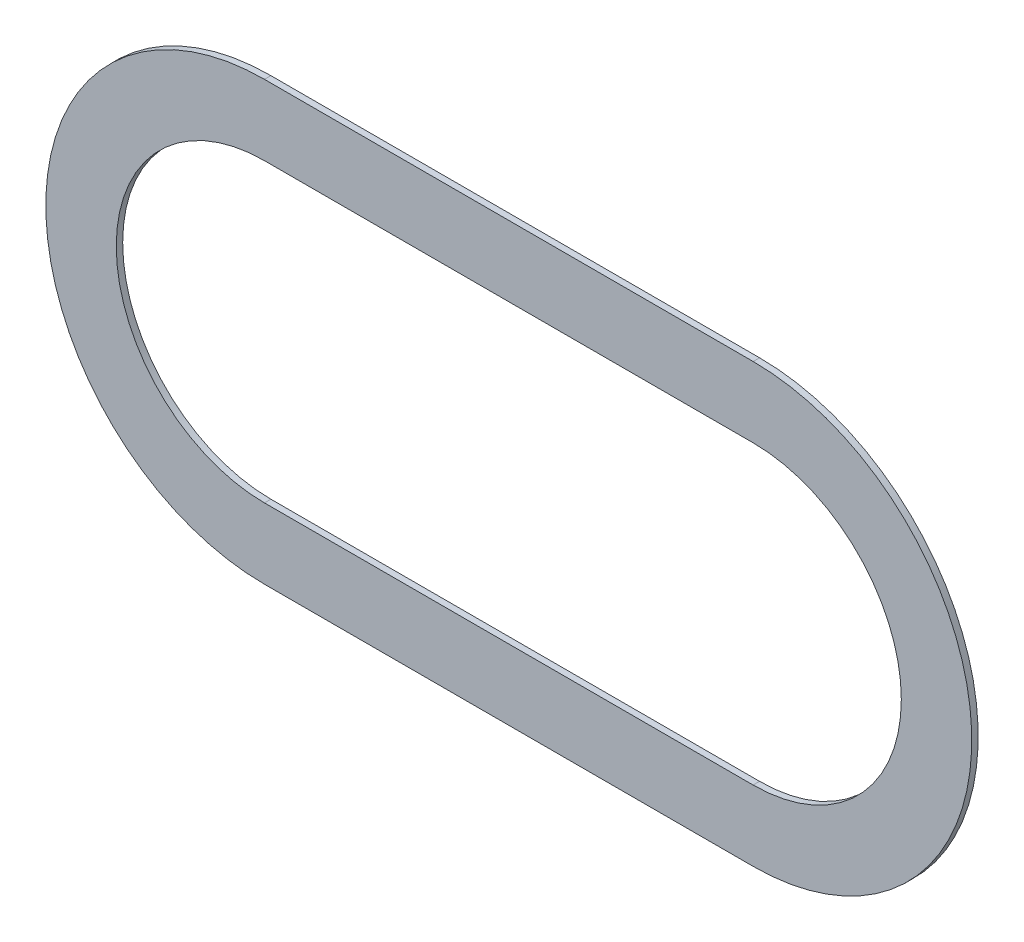
ISO-10303-21;
HEADER;
FILE_DESCRIPTION(('STEP AP214'),'2;1');
FILE_NAME('part.step','',(''),(''),'','','');
FILE_SCHEMA(('AUTOMOTIVE_DESIGN { 1 0 10303 214 1 1 1 1 }'));
ENDSEC;
DATA;
#1=APPLICATION_CONTEXT('core data for automotive mechanical design processes');
#2=APPLICATION_PROTOCOL_DEFINITION('international standard','automotive_design',2000,#1);
#3=PRODUCT_CONTEXT('',#1,'mechanical');
#4=PRODUCT('Part','Part','',(#3));
#5=PRODUCT_RELATED_PRODUCT_CATEGORY('part','',(#4));
#6=PRODUCT_DEFINITION_FORMATION('','',#4);
#7=PRODUCT_DEFINITION_CONTEXT('part definition',#1,'design');
#8=PRODUCT_DEFINITION('design','',#6,#7);
#9=PRODUCT_DEFINITION_SHAPE('','',#8);
#10=(LENGTH_UNIT() NAMED_UNIT(*) SI_UNIT(.MILLI.,.METRE.));
#11=(NAMED_UNIT(*) PLANE_ANGLE_UNIT() SI_UNIT($,.RADIAN.));
#12=(NAMED_UNIT(*) SI_UNIT($,.STERADIAN.) SOLID_ANGLE_UNIT());
#13=UNCERTAINTY_MEASURE_WITH_UNIT(LENGTH_MEASURE(1.E-05),#10,'distance_accuracy_value','');
#14=(GEOMETRIC_REPRESENTATION_CONTEXT(3) GLOBAL_UNCERTAINTY_ASSIGNED_CONTEXT((#13)) GLOBAL_UNIT_ASSIGNED_CONTEXT((#10,
#11,#12)) REPRESENTATION_CONTEXT('',''));
#15=CARTESIAN_POINT('',(0.,0.,0.));
#16=DIRECTION('',(0.,0.,1.));
#17=DIRECTION('',(1.,0.,0.));
#18=AXIS2_PLACEMENT_3D('',#15,#16,#17);
#19=CARTESIAN_POINT('',(22.4500010663178,4.93000023416243,0.));
#20=DIRECTION('',(0.,0.,-1.));
#21=DIRECTION('',(0.,-1.,0.));
#22=AXIS2_PLACEMENT_3D('',#19,#20,#21);
#23=PLANE('',#22);
#24=CARTESIAN_POINT('',(22.6400010753423,4.93000023416243,0.));
#25=DIRECTION('',(0.,0.,1.));
#26=DIRECTION('',(0.,1.,0.));
#27=AXIS2_PLACEMENT_3D('',#24,#25,#26);
#28=CIRCLE('',#27,0.115221704027137);
#29=CARTESIAN_POINT('',(22.6400010753423,4.8147785301353,0.));
#30=VERTEX_POINT('',#29);
#31=CARTESIAN_POINT('',(22.6400010753423,5.04522193818957,0.));
#32=VERTEX_POINT('',#31);
#33=EDGE_CURVE('E158',#30,#32,#28,.T.);
#34=ORIENTED_EDGE('',*,*,#33,.F.);
#35=DIRECTION('',(1.,0.,0.));
#36=VECTOR('',#35,1.);
#37=CARTESIAN_POINT('',(22.6400010753423,4.8147785301353,0.));
#38=LINE('',#37,#36);
#39=CARTESIAN_POINT('',(22.2600010572933,4.8147785301353,0.));
#40=VERTEX_POINT('',#39);
#41=EDGE_CURVE('E123',#40,#30,#38,.T.);
#42=ORIENTED_EDGE('',*,*,#41,.F.);
#43=CARTESIAN_POINT('',(22.2600010572933,4.93000023416243,0.));
#44=DIRECTION('',(0.,0.,1.));
#45=DIRECTION('',(0.,-1.,0.));
#46=AXIS2_PLACEMENT_3D('',#43,#44,#45);
#47=CIRCLE('',#46,0.115221704027137);
#48=CARTESIAN_POINT('',(22.2600010572933,5.04522193818957,0.));
#49=VERTEX_POINT('',#48);
#50=EDGE_CURVE('E115',#49,#40,#47,.T.);
#51=ORIENTED_EDGE('',*,*,#50,.F.);
#52=DIRECTION('',(-1.,0.,0.));
#53=VECTOR('',#52,1.);
#54=CARTESIAN_POINT('',(22.2600010572933,5.04522193818957,0.));
#55=LINE('',#54,#53);
#56=EDGE_CURVE('E99',#32,#49,#55,.T.);
#57=ORIENTED_EDGE('',*,*,#56,.F.);
#58=EDGE_LOOP('',(#34,#42,#51,#57));
#59=FACE_BOUND('',#58,.T.);
#60=CARTESIAN_POINT('',(22.6400010753423,4.93000023416243,0.));
#61=DIRECTION('',(0.,0.,-1.));
#62=DIRECTION('',(0.,1.,0.));
#63=AXIS2_PLACEMENT_3D('',#60,#61,#62);
#64=CIRCLE('',#63,0.170000008074567);
#65=CARTESIAN_POINT('',(22.6400010753423,5.100000242237,0.));
#66=VERTEX_POINT('',#65);
#67=CARTESIAN_POINT('',(22.6400010753423,4.76000022608787,0.));
#68=VERTEX_POINT('',#67);
#69=EDGE_CURVE('E28',#66,#68,#64,.T.);
#70=ORIENTED_EDGE('',*,*,#69,.F.);
#71=DIRECTION('',(1.,0.,0.));
#72=VECTOR('',#71,1.);
#73=CARTESIAN_POINT('',(22.2600010572933,5.100000242237,0.));
#74=LINE('',#73,#72);
#75=CARTESIAN_POINT('',(22.2600010572933,5.100000242237,0.));
#76=VERTEX_POINT('',#75);
#77=EDGE_CURVE('E142',#76,#66,#74,.T.);
#78=ORIENTED_EDGE('',*,*,#77,.F.);
#79=CARTESIAN_POINT('',(22.2600010572933,4.93000023416243,0.));
#80=DIRECTION('',(0.,0.,-1.));
#81=DIRECTION('',(0.,-1.,0.));
#82=AXIS2_PLACEMENT_3D('',#79,#80,#81);
#83=CIRCLE('',#82,0.170000008074567);
#84=CARTESIAN_POINT('',(22.2600010572933,4.76000022608787,0.));
#85=VERTEX_POINT('',#84);
#86=EDGE_CURVE('E153',#85,#76,#83,.T.);
#87=ORIENTED_EDGE('',*,*,#86,.F.);
#88=DIRECTION('',(-1.,0.,0.));
#89=VECTOR('',#88,1.);
#90=CARTESIAN_POINT('',(22.6400010753423,4.76000022608787,0.));
#91=LINE('',#90,#89);
#92=EDGE_CURVE('E162',#68,#85,#91,.T.);
#93=ORIENTED_EDGE('',*,*,#92,.F.);
#94=EDGE_LOOP('',(#70,#78,#87,#93));
#95=FACE_BOUND('',#94,.T.);
#96=ADVANCED_FACE('F17',(#59,#95),#23,.F.);
#97=CARTESIAN_POINT('',(22.4500010663178,4.93000023416243,-0.005));
#98=DIRECTION('',(0.,0.,-1.));
#99=DIRECTION('',(0.,-1.,0.));
#100=AXIS2_PLACEMENT_3D('',#97,#98,#99);
#101=PLANE('',#100);
#102=CARTESIAN_POINT('',(22.6400010753423,4.93000023416243,-0.005));
#103=DIRECTION('',(0.,0.,1.));
#104=DIRECTION('',(0.,1.,0.));
#105=AXIS2_PLACEMENT_3D('',#102,#103,#104);
#106=CIRCLE('',#105,0.115221704027137);
#107=CARTESIAN_POINT('',(22.6400010753423,4.8147785301353,-0.005));
#108=VERTEX_POINT('',#107);
#109=CARTESIAN_POINT('',(22.6400010753423,5.04522193818957,-0.005));
#110=VERTEX_POINT('',#109);
#111=EDGE_CURVE('E161',#108,#110,#106,.T.);
#112=ORIENTED_EDGE('',*,*,#111,.T.);
#113=DIRECTION('',(-1.,0.,0.));
#114=VECTOR('',#113,1.);
#115=CARTESIAN_POINT('',(22.2600010572933,5.04522193818957,-0.005));
#116=LINE('',#115,#114);
#117=CARTESIAN_POINT('',(22.2600010572933,5.04522193818957,-0.005));
#118=VERTEX_POINT('',#117);
#119=EDGE_CURVE('E109',#110,#118,#116,.T.);
#120=ORIENTED_EDGE('',*,*,#119,.T.);
#121=CARTESIAN_POINT('',(22.2600010572933,4.93000023416243,-0.005));
#122=DIRECTION('',(0.,0.,1.));
#123=DIRECTION('',(0.,-1.,0.));
#124=AXIS2_PLACEMENT_3D('',#121,#122,#123);
#125=CIRCLE('',#124,0.115221704027137);
#126=CARTESIAN_POINT('',(22.2600010572933,4.8147785301353,-0.005));
#127=VERTEX_POINT('',#126);
#128=EDGE_CURVE('E117',#118,#127,#125,.T.);
#129=ORIENTED_EDGE('',*,*,#128,.T.);
#130=DIRECTION('',(1.,0.,0.));
#131=VECTOR('',#130,1.);
#132=CARTESIAN_POINT('',(22.6400010753423,4.8147785301353,-0.005));
#133=LINE('',#132,#131);
#134=EDGE_CURVE('E131',#127,#108,#133,.T.);
#135=ORIENTED_EDGE('',*,*,#134,.T.);
#136=EDGE_LOOP('',(#112,#120,#129,#135));
#137=FACE_BOUND('',#136,.T.);
#138=CARTESIAN_POINT('',(22.6400010753423,4.93000023416243,-0.005));
#139=DIRECTION('',(0.,0.,-1.));
#140=DIRECTION('',(0.,1.,0.));
#141=AXIS2_PLACEMENT_3D('',#138,#139,#140);
#142=CIRCLE('',#141,0.170000008074567);
#143=CARTESIAN_POINT('',(22.6400010753423,5.100000242237,-0.005));
#144=VERTEX_POINT('',#143);
#145=CARTESIAN_POINT('',(22.6400010753423,4.76000022608787,-0.005));
#146=VERTEX_POINT('',#145);
#147=EDGE_CURVE('E11',#144,#146,#142,.T.);
#148=ORIENTED_EDGE('',*,*,#147,.T.);
#149=DIRECTION('',(-1.,0.,0.));
#150=VECTOR('',#149,1.);
#151=CARTESIAN_POINT('',(22.6400010753423,4.76000022608787,-0.005));
#152=LINE('',#151,#150);
#153=CARTESIAN_POINT('',(22.2600010572933,4.76000022608787,-0.005));
#154=VERTEX_POINT('',#153);
#155=EDGE_CURVE('E165',#146,#154,#152,.T.);
#156=ORIENTED_EDGE('',*,*,#155,.T.);
#157=CARTESIAN_POINT('',(22.2600010572933,4.93000023416243,-0.005));
#158=DIRECTION('',(0.,0.,-1.));
#159=DIRECTION('',(0.,-1.,0.));
#160=AXIS2_PLACEMENT_3D('',#157,#158,#159);
#161=CIRCLE('',#160,0.170000008074567);
#162=CARTESIAN_POINT('',(22.2600010572933,5.100000242237,-0.005));
#163=VERTEX_POINT('',#162);
#164=EDGE_CURVE('E21',#154,#163,#161,.T.);
#165=ORIENTED_EDGE('',*,*,#164,.T.);
#166=DIRECTION('',(1.,0.,0.));
#167=VECTOR('',#166,1.);
#168=CARTESIAN_POINT('',(22.2600010572933,5.100000242237,-0.005));
#169=LINE('',#168,#167);
#170=EDGE_CURVE('E141',#163,#144,#169,.T.);
#171=ORIENTED_EDGE('',*,*,#170,.T.);
#172=EDGE_LOOP('',(#148,#156,#165,#171));
#173=FACE_BOUND('',#172,.T.);
#174=ADVANCED_FACE('F204',(#137,#173),#101,.T.);
#175=CARTESIAN_POINT('',(22.6400010753423,4.93000023416243,0.));
#176=DIRECTION('',(0.,0.,-1.));
#177=DIRECTION('',(0.,1.,0.));
#178=AXIS2_PLACEMENT_3D('',#175,#176,#177);
#179=CYLINDRICAL_SURFACE('',#178,0.170000008074567);
#180=ORIENTED_EDGE('',*,*,#69,.T.);
#181=DIRECTION('',(0.,0.,-1.));
#182=VECTOR('',#181,1.);
#183=CARTESIAN_POINT('',(22.6400010753423,4.76000022608787,0.));
#184=LINE('',#183,#182);
#185=EDGE_CURVE('E169',#68,#146,#184,.T.);
#186=ORIENTED_EDGE('',*,*,#185,.T.);
#187=ORIENTED_EDGE('',*,*,#147,.F.);
#188=DIRECTION('',(0.,0.,-1.));
#189=VECTOR('',#188,1.);
#190=CARTESIAN_POINT('',(22.6400010753423,5.100000242237,0.));
#191=LINE('',#190,#189);
#192=EDGE_CURVE('E137',#66,#144,#191,.T.);
#193=ORIENTED_EDGE('',*,*,#192,.F.);
#194=EDGE_LOOP('',(#180,#186,#187,#193));
#195=FACE_BOUND('',#194,.T.);
#196=ADVANCED_FACE('F189',(#195),#179,.T.);
#197=CARTESIAN_POINT('',(22.6400010753423,4.76000022608787,0.));
#198=DIRECTION('',(0.,-1.,0.));
#199=DIRECTION('',(0.,0.,-1.));
#200=AXIS2_PLACEMENT_3D('',#197,#198,#199);
#201=PLANE('',#200);
#202=ORIENTED_EDGE('',*,*,#92,.T.);
#203=DIRECTION('',(0.,0.,-1.));
#204=VECTOR('',#203,1.);
#205=CARTESIAN_POINT('',(22.2600010572933,4.76000022608787,0.));
#206=LINE('',#205,#204);
#207=EDGE_CURVE('E166',#85,#154,#206,.T.);
#208=ORIENTED_EDGE('',*,*,#207,.T.);
#209=ORIENTED_EDGE('',*,*,#155,.F.);
#210=ORIENTED_EDGE('',*,*,#185,.F.);
#211=EDGE_LOOP('',(#202,#208,#209,#210));
#212=FACE_BOUND('',#211,.T.);
#213=ADVANCED_FACE('F194',(#212),#201,.T.);
#214=CARTESIAN_POINT('',(22.2600010572933,4.93000023416243,0.));
#215=DIRECTION('',(0.,0.,-1.));
#216=DIRECTION('',(0.,-1.,0.));
#217=AXIS2_PLACEMENT_3D('',#214,#215,#216);
#218=CYLINDRICAL_SURFACE('',#217,0.170000008074567);
#219=ORIENTED_EDGE('',*,*,#86,.T.);
#220=DIRECTION('',(0.,0.,-1.));
#221=VECTOR('',#220,1.);
#222=CARTESIAN_POINT('',(22.2600010572933,5.100000242237,0.));
#223=LINE('',#222,#221);
#224=EDGE_CURVE('E149',#76,#163,#223,.T.);
#225=ORIENTED_EDGE('',*,*,#224,.T.);
#226=ORIENTED_EDGE('',*,*,#164,.F.);
#227=ORIENTED_EDGE('',*,*,#207,.F.);
#228=EDGE_LOOP('',(#219,#225,#226,#227));
#229=FACE_BOUND('',#228,.T.);
#230=ADVANCED_FACE('F199',(#229),#218,.T.);
#231=CARTESIAN_POINT('',(22.2600010572933,5.100000242237,0.));
#232=DIRECTION('',(0.,1.,0.));
#233=DIRECTION('',(1.,0.,0.));
#234=AXIS2_PLACEMENT_3D('',#231,#232,#233);
#235=PLANE('',#234);
#236=ORIENTED_EDGE('',*,*,#77,.T.);
#237=ORIENTED_EDGE('',*,*,#192,.T.);
#238=ORIENTED_EDGE('',*,*,#170,.F.);
#239=ORIENTED_EDGE('',*,*,#224,.F.);
#240=EDGE_LOOP('',(#236,#237,#238,#239));
#241=FACE_BOUND('',#240,.T.);
#242=ADVANCED_FACE('F203',(#241),#235,.T.);
#243=CARTESIAN_POINT('',(22.6400010753423,4.93000023416243,0.));
#244=DIRECTION('',(0.,0.,-1.));
#245=DIRECTION('',(0.,1.,0.));
#246=AXIS2_PLACEMENT_3D('',#243,#244,#245);
#247=CYLINDRICAL_SURFACE('',#246,0.115221704027137);
#248=ORIENTED_EDGE('',*,*,#33,.T.);
#249=DIRECTION('',(0.,0.,-1.));
#250=VECTOR('',#249,1.);
#251=CARTESIAN_POINT('',(22.6400010753423,5.04522193818957,0.));
#252=LINE('',#251,#250);
#253=EDGE_CURVE('E105',#32,#110,#252,.T.);
#254=ORIENTED_EDGE('',*,*,#253,.T.);
#255=ORIENTED_EDGE('',*,*,#111,.F.);
#256=DIRECTION('',(0.,0.,-1.));
#257=VECTOR('',#256,1.);
#258=CARTESIAN_POINT('',(22.6400010753423,4.8147785301353,0.));
#259=LINE('',#258,#257);
#260=EDGE_CURVE('E136',#30,#108,#259,.T.);
#261=ORIENTED_EDGE('',*,*,#260,.F.);
#262=EDGE_LOOP('',(#248,#254,#255,#261));
#263=FACE_BOUND('',#262,.T.);
#264=ADVANCED_FACE('F243',(#263),#247,.F.);
#265=CARTESIAN_POINT('',(22.6400010753423,5.04522193818957,0.));
#266=DIRECTION('',(0.,-1.,0.));
#267=DIRECTION('',(0.,0.,-1.));
#268=AXIS2_PLACEMENT_3D('',#265,#266,#267);
#269=PLANE('',#268);
#270=ORIENTED_EDGE('',*,*,#56,.T.);
#271=DIRECTION('',(0.,0.,-1.));
#272=VECTOR('',#271,1.);
#273=CARTESIAN_POINT('',(22.2600010572933,5.04522193818957,0.));
#274=LINE('',#273,#272);
#275=EDGE_CURVE('E102',#49,#118,#274,.T.);
#276=ORIENTED_EDGE('',*,*,#275,.T.);
#277=ORIENTED_EDGE('',*,*,#119,.F.);
#278=ORIENTED_EDGE('',*,*,#253,.F.);
#279=EDGE_LOOP('',(#270,#276,#277,#278));
#280=FACE_BOUND('',#279,.T.);
#281=ADVANCED_FACE('F19',(#280),#269,.T.);
#282=CARTESIAN_POINT('',(22.2600010572933,4.93000023416243,0.));
#283=DIRECTION('',(0.,0.,-1.));
#284=DIRECTION('',(0.,-1.,0.));
#285=AXIS2_PLACEMENT_3D('',#282,#283,#284);
#286=CYLINDRICAL_SURFACE('',#285,0.115221704027137);
#287=ORIENTED_EDGE('',*,*,#50,.T.);
#288=DIRECTION('',(0.,0.,-1.));
#289=VECTOR('',#288,1.);
#290=CARTESIAN_POINT('',(22.2600010572933,4.8147785301353,0.));
#291=LINE('',#290,#289);
#292=EDGE_CURVE('E125',#40,#127,#291,.T.);
#293=ORIENTED_EDGE('',*,*,#292,.T.);
#294=ORIENTED_EDGE('',*,*,#128,.F.);
#295=ORIENTED_EDGE('',*,*,#275,.F.);
#296=EDGE_LOOP('',(#287,#293,#294,#295));
#297=FACE_BOUND('',#296,.T.);
#298=ADVANCED_FACE('F113',(#297),#286,.F.);
#299=CARTESIAN_POINT('',(22.2600010572933,4.8147785301353,0.));
#300=DIRECTION('',(0.,1.,0.));
#301=DIRECTION('',(1.,0.,0.));
#302=AXIS2_PLACEMENT_3D('',#299,#300,#301);
#303=PLANE('',#302);
#304=ORIENTED_EDGE('',*,*,#41,.T.);
#305=ORIENTED_EDGE('',*,*,#260,.T.);
#306=ORIENTED_EDGE('',*,*,#134,.F.);
#307=ORIENTED_EDGE('',*,*,#292,.F.);
#308=EDGE_LOOP('',(#304,#305,#306,#307));
#309=FACE_BOUND('',#308,.T.);
#310=ADVANCED_FACE('F223',(#309),#303,.T.);
#311=CLOSED_SHELL('',(#96,#174,#196,#213,#230,#242,#264,#281,#298,#310));
#312=MANIFOLD_SOLID_BREP('B1',#311);
#313=ADVANCED_BREP_SHAPE_REPRESENTATION('',(#18,#312),#14);
#314=SHAPE_DEFINITION_REPRESENTATION(#9,#313);
ENDSEC;
END-ISO-10303-21;
